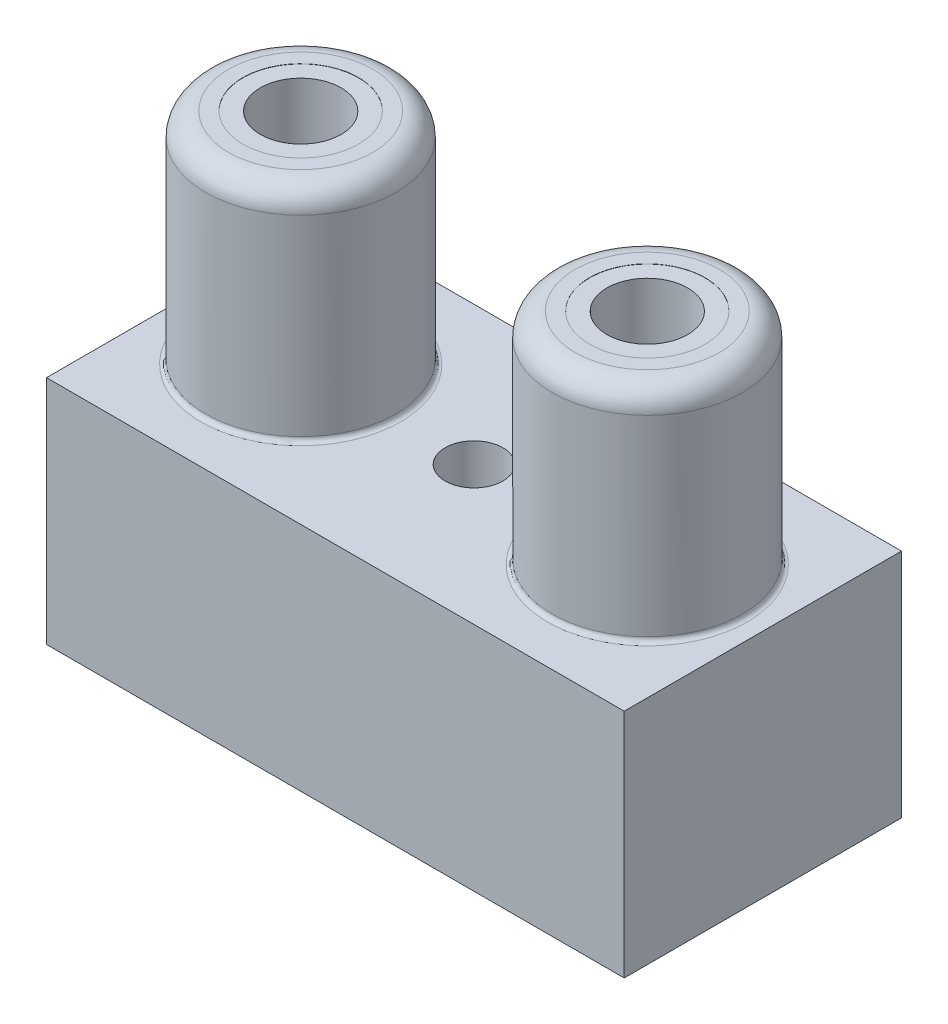
ISO-10303-21;
HEADER;
FILE_DESCRIPTION(('STEP AP214'),'2;1');
FILE_NAME('part.step','',(''),(''),'','','');
FILE_SCHEMA(('AUTOMOTIVE_DESIGN { 1 0 10303 214 1 1 1 1 }'));
ENDSEC;
DATA;
#1=APPLICATION_CONTEXT('core data for automotive mechanical design processes');
#2=APPLICATION_PROTOCOL_DEFINITION('international standard','automotive_design',2000,#1);
#3=PRODUCT_CONTEXT('',#1,'mechanical');
#4=PRODUCT('Part','Part','',(#3));
#5=PRODUCT_RELATED_PRODUCT_CATEGORY('part','',(#4));
#6=PRODUCT_DEFINITION_FORMATION('','',#4);
#7=PRODUCT_DEFINITION_CONTEXT('part definition',#1,'design');
#8=PRODUCT_DEFINITION('design','',#6,#7);
#9=PRODUCT_DEFINITION_SHAPE('','',#8);
#10=(LENGTH_UNIT() NAMED_UNIT(*) SI_UNIT(.MILLI.,.METRE.));
#11=(NAMED_UNIT(*) PLANE_ANGLE_UNIT() SI_UNIT($,.RADIAN.));
#12=(NAMED_UNIT(*) SI_UNIT($,.STERADIAN.) SOLID_ANGLE_UNIT());
#13=UNCERTAINTY_MEASURE_WITH_UNIT(LENGTH_MEASURE(1.E-05),#10,'distance_accuracy_value','');
#14=(GEOMETRIC_REPRESENTATION_CONTEXT(3) GLOBAL_UNCERTAINTY_ASSIGNED_CONTEXT((#13)) GLOBAL_UNIT_ASSIGNED_CONTEXT((#10,
#11,#12)) REPRESENTATION_CONTEXT('',''));
#15=CARTESIAN_POINT('',(0.,0.,0.));
#16=DIRECTION('',(0.,0.,1.));
#17=DIRECTION('',(1.,0.,0.));
#18=AXIS2_PLACEMENT_3D('',#15,#16,#17);
#19=CARTESIAN_POINT('',(0.,10.,0.));
#20=DIRECTION('',(0.,-1.,0.));
#21=DIRECTION('',(0.,0.,-1.));
#22=AXIS2_PLACEMENT_3D('',#19,#20,#21);
#23=PLANE('',#22);
#24=CARTESIAN_POINT('',(20.,10.,-6.));
#25=DIRECTION('',(0.,-1.,0.));
#26=DIRECTION('',(0.,0.,-1.));
#27=AXIS2_PLACEMENT_3D('',#24,#25,#26);
#28=CIRCLE('',#27,4.32);
#29=CARTESIAN_POINT('',(20.,10.,-10.32));
#30=VERTEX_POINT('',#29);
#31=EDGE_CURVE('E43',#30,#30,#28,.T.);
#32=ORIENTED_EDGE('',*,*,#31,.T.);
#33=EDGE_LOOP('',(#32));
#34=FACE_BOUND('',#33,.T.);
#35=CARTESIAN_POINT('',(5.,10.,-6.));
#36=DIRECTION('',(0.,-1.,0.));
#37=DIRECTION('',(0.,0.,-1.));
#38=AXIS2_PLACEMENT_3D('',#35,#36,#37);
#39=CIRCLE('',#38,4.32);
#40=CARTESIAN_POINT('',(5.,10.,-10.32));
#41=VERTEX_POINT('',#40);
#42=EDGE_CURVE('E126',#41,#41,#39,.T.);
#43=ORIENTED_EDGE('',*,*,#42,.T.);
#44=EDGE_LOOP('',(#43));
#45=FACE_BOUND('',#44,.T.);
#46=CARTESIAN_POINT('',(12.5,10.,-6.));
#47=DIRECTION('',(0.,1.,0.));
#48=DIRECTION('',(0.,0.,1.));
#49=AXIS2_PLACEMENT_3D('',#46,#47,#48);
#50=CIRCLE('',#49,1.25);
#51=CARTESIAN_POINT('',(12.5,10.,-4.75));
#52=VERTEX_POINT('',#51);
#53=EDGE_CURVE('E412',#52,#52,#50,.T.);
#54=ORIENTED_EDGE('',*,*,#53,.F.);
#55=EDGE_LOOP('',(#54));
#56=FACE_BOUND('',#55,.T.);
#57=DIRECTION('',(0.,0.,1.));
#58=VECTOR('',#57,1.);
#59=CARTESIAN_POINT('',(0.,10.,0.));
#60=LINE('',#59,#58);
#61=CARTESIAN_POINT('',(0.,10.,-12.));
#62=VERTEX_POINT('',#61);
#63=CARTESIAN_POINT('',(0.,10.,0.));
#64=VERTEX_POINT('',#63);
#65=EDGE_CURVE('E86',#62,#64,#60,.T.);
#66=ORIENTED_EDGE('',*,*,#65,.T.);
#67=DIRECTION('',(1.,0.,0.));
#68=VECTOR('',#67,1.);
#69=CARTESIAN_POINT('',(0.,10.,0.));
#70=LINE('',#69,#68);
#71=CARTESIAN_POINT('',(25.,10.,0.));
#72=VERTEX_POINT('',#71);
#73=EDGE_CURVE('E82',#64,#72,#70,.T.);
#74=ORIENTED_EDGE('',*,*,#73,.T.);
#75=DIRECTION('',(0.,0.,-1.));
#76=VECTOR('',#75,1.);
#77=CARTESIAN_POINT('',(25.,10.,0.));
#78=LINE('',#77,#76);
#79=CARTESIAN_POINT('',(25.,10.,-12.));
#80=VERTEX_POINT('',#79);
#81=EDGE_CURVE('E84',#72,#80,#78,.T.);
#82=ORIENTED_EDGE('',*,*,#81,.T.);
#83=DIRECTION('',(-1.,0.,0.));
#84=VECTOR('',#83,1.);
#85=CARTESIAN_POINT('',(0.,10.,-12.));
#86=LINE('',#85,#84);
#87=EDGE_CURVE('E51',#80,#62,#86,.T.);
#88=ORIENTED_EDGE('',*,*,#87,.T.);
#89=EDGE_LOOP('',(#66,#74,#82,#88));
#90=FACE_BOUND('',#89,.T.);
#91=ADVANCED_FACE('F34',(#34,#45,#56,#90),#23,.F.);
#92=CARTESIAN_POINT('',(0.,10.,0.));
#93=DIRECTION('',(1.,0.,0.));
#94=DIRECTION('',(0.,0.,-1.));
#95=AXIS2_PLACEMENT_3D('',#92,#93,#94);
#96=PLANE('',#95);
#97=DIRECTION('',(0.,0.,1.));
#98=VECTOR('',#97,1.);
#99=CARTESIAN_POINT('',(0.,0.,0.));
#100=LINE('',#99,#98);
#101=CARTESIAN_POINT('',(0.,0.,-12.));
#102=VERTEX_POINT('',#101);
#103=CARTESIAN_POINT('',(0.,0.,0.));
#104=VERTEX_POINT('',#103);
#105=EDGE_CURVE('E101',#102,#104,#100,.T.);
#106=ORIENTED_EDGE('',*,*,#105,.T.);
#107=DIRECTION('',(0.,-1.,0.));
#108=VECTOR('',#107,1.);
#109=CARTESIAN_POINT('',(0.,10.,0.));
#110=LINE('',#109,#108);
#111=EDGE_CURVE('E92',#64,#104,#110,.T.);
#112=ORIENTED_EDGE('',*,*,#111,.F.);
#113=ORIENTED_EDGE('',*,*,#65,.F.);
#114=DIRECTION('',(0.,-1.,0.));
#115=VECTOR('',#114,1.);
#116=CARTESIAN_POINT('',(0.,10.,-12.));
#117=LINE('',#116,#115);
#118=EDGE_CURVE('E97',#62,#102,#117,.T.);
#119=ORIENTED_EDGE('',*,*,#118,.T.);
#120=EDGE_LOOP('',(#106,#112,#113,#119));
#121=FACE_BOUND('',#120,.T.);
#122=ADVANCED_FACE('F190',(#121),#96,.F.);
#123=CARTESIAN_POINT('',(0.,10.,0.));
#124=DIRECTION('',(0.,0.,-1.));
#125=DIRECTION('',(-1.,0.,0.));
#126=AXIS2_PLACEMENT_3D('',#123,#124,#125);
#127=PLANE('',#126);
#128=DIRECTION('',(1.,0.,0.));
#129=VECTOR('',#128,1.);
#130=CARTESIAN_POINT('',(0.,0.,0.));
#131=LINE('',#130,#129);
#132=CARTESIAN_POINT('',(25.,0.,0.));
#133=VERTEX_POINT('',#132);
#134=EDGE_CURVE('E91',#104,#133,#131,.T.);
#135=ORIENTED_EDGE('',*,*,#134,.T.);
#136=DIRECTION('',(0.,-1.,0.));
#137=VECTOR('',#136,1.);
#138=CARTESIAN_POINT('',(25.,10.,0.));
#139=LINE('',#138,#137);
#140=EDGE_CURVE('E89',#72,#133,#139,.T.);
#141=ORIENTED_EDGE('',*,*,#140,.F.);
#142=ORIENTED_EDGE('',*,*,#73,.F.);
#143=ORIENTED_EDGE('',*,*,#111,.T.);
#144=EDGE_LOOP('',(#135,#141,#142,#143));
#145=FACE_BOUND('',#144,.T.);
#146=ADVANCED_FACE('F90',(#145),#127,.F.);
#147=CARTESIAN_POINT('',(25.,10.,0.));
#148=DIRECTION('',(-1.,0.,0.));
#149=DIRECTION('',(0.,0.,1.));
#150=AXIS2_PLACEMENT_3D('',#147,#148,#149);
#151=PLANE('',#150);
#152=DIRECTION('',(0.,0.,-1.));
#153=VECTOR('',#152,1.);
#154=CARTESIAN_POINT('',(25.,0.,0.));
#155=LINE('',#154,#153);
#156=CARTESIAN_POINT('',(25.,0.,-12.));
#157=VERTEX_POINT('',#156);
#158=EDGE_CURVE('E68',#133,#157,#155,.T.);
#159=ORIENTED_EDGE('',*,*,#158,.T.);
#160=DIRECTION('',(0.,-1.,0.));
#161=VECTOR('',#160,1.);
#162=CARTESIAN_POINT('',(25.,10.,-12.));
#163=LINE('',#162,#161);
#164=EDGE_CURVE('E93',#80,#157,#163,.T.);
#165=ORIENTED_EDGE('',*,*,#164,.F.);
#166=ORIENTED_EDGE('',*,*,#81,.F.);
#167=ORIENTED_EDGE('',*,*,#140,.T.);
#168=EDGE_LOOP('',(#159,#165,#166,#167));
#169=FACE_BOUND('',#168,.T.);
#170=ADVANCED_FACE('F95',(#169),#151,.F.);
#171=CARTESIAN_POINT('',(0.,10.,-12.));
#172=DIRECTION('',(0.,0.,1.));
#173=DIRECTION('',(1.,0.,0.));
#174=AXIS2_PLACEMENT_3D('',#171,#172,#173);
#175=PLANE('',#174);
#176=DIRECTION('',(-1.,0.,0.));
#177=VECTOR('',#176,1.);
#178=CARTESIAN_POINT('',(0.,0.,-12.));
#179=LINE('',#178,#177);
#180=EDGE_CURVE('E74',#157,#102,#179,.T.);
#181=ORIENTED_EDGE('',*,*,#180,.T.);
#182=ORIENTED_EDGE('',*,*,#118,.F.);
#183=ORIENTED_EDGE('',*,*,#87,.F.);
#184=ORIENTED_EDGE('',*,*,#164,.T.);
#185=EDGE_LOOP('',(#181,#182,#183,#184));
#186=FACE_BOUND('',#185,.T.);
#187=ADVANCED_FACE('F200',(#186),#175,.F.);
#188=CARTESIAN_POINT('',(0.,0.,0.));
#189=DIRECTION('',(0.,-1.,0.));
#190=DIRECTION('',(0.,0.,-1.));
#191=AXIS2_PLACEMENT_3D('',#188,#189,#190);
#192=PLANE('',#191);
#193=CARTESIAN_POINT('',(12.5,0.,-6.));
#194=DIRECTION('',(0.,1.,0.));
#195=DIRECTION('',(0.,0.,1.));
#196=AXIS2_PLACEMENT_3D('',#193,#194,#195);
#197=CIRCLE('',#196,1.25);
#198=CARTESIAN_POINT('',(12.5,0.,-4.75));
#199=VERTEX_POINT('',#198);
#200=EDGE_CURVE('E410',#199,#199,#197,.T.);
#201=ORIENTED_EDGE('',*,*,#200,.T.);
#202=EDGE_LOOP('',(#201));
#203=FACE_BOUND('',#202,.T.);
#204=ORIENTED_EDGE('',*,*,#105,.F.);
#205=ORIENTED_EDGE('',*,*,#180,.F.);
#206=ORIENTED_EDGE('',*,*,#158,.F.);
#207=ORIENTED_EDGE('',*,*,#134,.F.);
#208=EDGE_LOOP('',(#204,#205,#206,#207));
#209=FACE_BOUND('',#208,.T.);
#210=ADVANCED_FACE('F186',(#203,#209),#192,.T.);
#211=CARTESIAN_POINT('',(5.,19.5,-6.));
#212=DIRECTION('',(0.,-1.,0.));
#213=DIRECTION('',(0.,0.,-1.));
#214=AXIS2_PLACEMENT_3D('',#211,#212,#213);
#215=CYLINDRICAL_SURFACE('',#214,4.12);
#216=CARTESIAN_POINT('',(5.,10.2,-6.));
#217=DIRECTION('',(0.,-1.,0.));
#218=DIRECTION('',(0.,0.,-1.));
#219=AXIS2_PLACEMENT_3D('',#216,#217,#218);
#220=CIRCLE('',#219,4.12);
#221=CARTESIAN_POINT('',(5.,10.2,-10.12));
#222=VERTEX_POINT('',#221);
#223=EDGE_CURVE('E11',#222,#222,#220,.F.);
#224=ORIENTED_EDGE('',*,*,#223,.T.);
#225=EDGE_LOOP('',(#224));
#226=FACE_BOUND('',#225,.T.);
#227=CARTESIAN_POINT('',(5.,18.5,-6.));
#228=DIRECTION('',(0.,1.,0.));
#229=DIRECTION('',(0.,0.,1.));
#230=AXIS2_PLACEMENT_3D('',#227,#228,#229);
#231=CIRCLE('',#230,4.12);
#232=CARTESIAN_POINT('',(5.,18.5,-1.88));
#233=VERTEX_POINT('',#232);
#234=EDGE_CURVE('E120',#233,#233,#231,.F.);
#235=ORIENTED_EDGE('',*,*,#234,.T.);
#236=EDGE_LOOP('',(#235));
#237=FACE_BOUND('',#236,.T.);
#238=ADVANCED_FACE('F180',(#226,#237),#215,.T.);
#239=CARTESIAN_POINT('',(5.,19.5,-6.));
#240=DIRECTION('',(0.,1.,0.));
#241=DIRECTION('',(0.,0.,1.));
#242=AXIS2_PLACEMENT_3D('',#239,#240,#241);
#243=PLANE('',#242);
#244=CARTESIAN_POINT('',(5.,19.5,-6.));
#245=DIRECTION('',(0.,1.,0.));
#246=DIRECTION('',(0.,0.,1.));
#247=AXIS2_PLACEMENT_3D('',#244,#245,#246);
#248=CIRCLE('',#247,3.12);
#249=CARTESIAN_POINT('',(5.,19.5,-2.88));
#250=VERTEX_POINT('',#249);
#251=EDGE_CURVE('E117',#250,#250,#248,.T.);
#252=ORIENTED_EDGE('',*,*,#251,.T.);
#253=EDGE_LOOP('',(#252));
#254=FACE_BOUND('',#253,.T.);
#255=CARTESIAN_POINT('',(5.,19.5,-6.));
#256=DIRECTION('',(0.,1.,0.));
#257=DIRECTION('',(0.,0.,1.));
#258=AXIS2_PLACEMENT_3D('',#255,#256,#257);
#259=CIRCLE('',#258,2.5);
#260=CARTESIAN_POINT('',(5.,19.5,-3.5));
#261=VERTEX_POINT('',#260);
#262=EDGE_CURVE('E166',#261,#261,#259,.T.);
#263=ORIENTED_EDGE('',*,*,#262,.F.);
#264=EDGE_LOOP('',(#263));
#265=FACE_BOUND('',#264,.T.);
#266=ADVANCED_FACE('F143',(#254,#265),#243,.T.);
#267=CARTESIAN_POINT('',(20.,19.5,-6.));
#268=DIRECTION('',(0.,-1.,0.));
#269=DIRECTION('',(0.,0.,-1.));
#270=AXIS2_PLACEMENT_3D('',#267,#268,#269);
#271=CYLINDRICAL_SURFACE('',#270,4.12);
#272=CARTESIAN_POINT('',(20.,10.2,-6.));
#273=DIRECTION('',(0.,-1.,0.));
#274=DIRECTION('',(0.,0.,-1.));
#275=AXIS2_PLACEMENT_3D('',#272,#273,#274);
#276=CIRCLE('',#275,4.12);
#277=CARTESIAN_POINT('',(20.,10.2,-10.12));
#278=VERTEX_POINT('',#277);
#279=EDGE_CURVE('E123',#278,#278,#276,.F.);
#280=ORIENTED_EDGE('',*,*,#279,.T.);
#281=EDGE_LOOP('',(#280));
#282=FACE_BOUND('',#281,.T.);
#283=CARTESIAN_POINT('',(20.,18.5,-6.));
#284=DIRECTION('',(0.,1.,0.));
#285=DIRECTION('',(0.,0.,1.));
#286=AXIS2_PLACEMENT_3D('',#283,#284,#285);
#287=CIRCLE('',#286,4.12);
#288=CARTESIAN_POINT('',(20.,18.5,-1.88));
#289=VERTEX_POINT('',#288);
#290=EDGE_CURVE('E114',#289,#289,#287,.F.);
#291=ORIENTED_EDGE('',*,*,#290,.T.);
#292=EDGE_LOOP('',(#291));
#293=FACE_BOUND('',#292,.T.);
#294=ADVANCED_FACE('F139',(#282,#293),#271,.T.);
#295=CARTESIAN_POINT('',(20.,19.5,-6.));
#296=DIRECTION('',(0.,1.,0.));
#297=DIRECTION('',(0.,0.,1.));
#298=AXIS2_PLACEMENT_3D('',#295,#296,#297);
#299=PLANE('',#298);
#300=CARTESIAN_POINT('',(20.,19.5,-6.));
#301=DIRECTION('',(0.,1.,0.));
#302=DIRECTION('',(0.,0.,1.));
#303=AXIS2_PLACEMENT_3D('',#300,#301,#302);
#304=CIRCLE('',#303,3.12);
#305=CARTESIAN_POINT('',(20.,19.5,-2.88));
#306=VERTEX_POINT('',#305);
#307=EDGE_CURVE('E111',#306,#306,#304,.T.);
#308=ORIENTED_EDGE('',*,*,#307,.T.);
#309=EDGE_LOOP('',(#308));
#310=FACE_BOUND('',#309,.T.);
#311=CARTESIAN_POINT('',(20.,19.5,-6.));
#312=DIRECTION('',(0.,1.,0.));
#313=DIRECTION('',(0.,0.,1.));
#314=AXIS2_PLACEMENT_3D('',#311,#312,#313);
#315=CIRCLE('',#314,2.5);
#316=CARTESIAN_POINT('',(20.,19.5,-3.5));
#317=VERTEX_POINT('',#316);
#318=EDGE_CURVE('E160',#317,#317,#315,.T.);
#319=ORIENTED_EDGE('',*,*,#318,.F.);
#320=EDGE_LOOP('',(#319));
#321=FACE_BOUND('',#320,.T.);
#322=ADVANCED_FACE('F142',(#310,#321),#299,.T.);
#323=CARTESIAN_POINT('',(5.,19.49,-6.));
#324=DIRECTION('',(0.,1.,0.));
#325=DIRECTION('',(0.,0.,1.));
#326=AXIS2_PLACEMENT_3D('',#323,#324,#325);
#327=CYLINDRICAL_SURFACE('',#326,2.5);
#328=CARTESIAN_POINT('',(5.,19.49,-6.));
#329=DIRECTION('',(0.,1.,0.));
#330=DIRECTION('',(0.,0.,1.));
#331=AXIS2_PLACEMENT_3D('',#328,#329,#330);
#332=CIRCLE('',#331,2.5);
#333=CARTESIAN_POINT('',(5.,19.49,-3.5));
#334=VERTEX_POINT('',#333);
#335=EDGE_CURVE('E104',#334,#334,#332,.T.);
#336=ORIENTED_EDGE('',*,*,#335,.F.);
#337=EDGE_LOOP('',(#336));
#338=FACE_BOUND('',#337,.T.);
#339=ORIENTED_EDGE('',*,*,#262,.T.);
#340=EDGE_LOOP('',(#339));
#341=FACE_BOUND('',#340,.T.);
#342=ADVANCED_FACE('F156',(#338,#341),#327,.F.);
#343=CARTESIAN_POINT('',(5.,19.49,-6.));
#344=DIRECTION('',(0.,1.,0.));
#345=DIRECTION('',(0.,0.,1.));
#346=AXIS2_PLACEMENT_3D('',#343,#344,#345);
#347=PLANE('',#346);
#348=CARTESIAN_POINT('',(5.,19.49,-6.));
#349=DIRECTION('',(0.,1.,0.));
#350=DIRECTION('',(0.,0.,1.));
#351=AXIS2_PLACEMENT_3D('',#348,#349,#350);
#352=CIRCLE('',#351,1.75);
#353=CARTESIAN_POINT('',(5.,19.49,-4.25));
#354=VERTEX_POINT('',#353);
#355=EDGE_CURVE('E169',#354,#354,#352,.T.);
#356=ORIENTED_EDGE('',*,*,#355,.F.);
#357=EDGE_LOOP('',(#356));
#358=FACE_BOUND('',#357,.T.);
#359=ORIENTED_EDGE('',*,*,#335,.T.);
#360=EDGE_LOOP('',(#359));
#361=FACE_BOUND('',#360,.T.);
#362=ADVANCED_FACE('F305',(#358,#361),#347,.T.);
#363=CARTESIAN_POINT('',(20.,19.49,-6.));
#364=DIRECTION('',(0.,1.,0.));
#365=DIRECTION('',(0.,0.,1.));
#366=AXIS2_PLACEMENT_3D('',#363,#364,#365);
#367=CYLINDRICAL_SURFACE('',#366,2.5);
#368=CARTESIAN_POINT('',(20.,19.49,-6.));
#369=DIRECTION('',(0.,1.,0.));
#370=DIRECTION('',(0.,0.,1.));
#371=AXIS2_PLACEMENT_3D('',#368,#369,#370);
#372=CIRCLE('',#371,2.5);
#373=CARTESIAN_POINT('',(20.,19.49,-3.5));
#374=VERTEX_POINT('',#373);
#375=EDGE_CURVE('E162',#374,#374,#372,.T.);
#376=ORIENTED_EDGE('',*,*,#375,.F.);
#377=EDGE_LOOP('',(#376));
#378=FACE_BOUND('',#377,.T.);
#379=ORIENTED_EDGE('',*,*,#318,.T.);
#380=EDGE_LOOP('',(#379));
#381=FACE_BOUND('',#380,.T.);
#382=ADVANCED_FACE('F294',(#378,#381),#367,.F.);
#383=CARTESIAN_POINT('',(20.,19.49,-6.));
#384=DIRECTION('',(0.,1.,0.));
#385=DIRECTION('',(0.,0.,1.));
#386=AXIS2_PLACEMENT_3D('',#383,#384,#385);
#387=PLANE('',#386);
#388=CARTESIAN_POINT('',(20.,19.49,-6.));
#389=DIRECTION('',(0.,1.,0.));
#390=DIRECTION('',(0.,0.,1.));
#391=AXIS2_PLACEMENT_3D('',#388,#389,#390);
#392=CIRCLE('',#391,1.75);
#393=CARTESIAN_POINT('',(20.,19.49,-4.25));
#394=VERTEX_POINT('',#393);
#395=EDGE_CURVE('E406',#394,#394,#392,.T.);
#396=ORIENTED_EDGE('',*,*,#395,.F.);
#397=EDGE_LOOP('',(#396));
#398=FACE_BOUND('',#397,.T.);
#399=ORIENTED_EDGE('',*,*,#375,.T.);
#400=EDGE_LOOP('',(#399));
#401=FACE_BOUND('',#400,.T.);
#402=ADVANCED_FACE('F285',(#398,#401),#387,.T.);
#403=CARTESIAN_POINT('',(5.,4.49,-6.));
#404=DIRECTION('',(0.,1.,0.));
#405=DIRECTION('',(0.,0.,1.));
#406=AXIS2_PLACEMENT_3D('',#403,#404,#405);
#407=CYLINDRICAL_SURFACE('',#406,1.75);
#408=CARTESIAN_POINT('',(5.,4.49,-6.));
#409=DIRECTION('',(0.,1.,0.));
#410=DIRECTION('',(0.,0.,1.));
#411=AXIS2_PLACEMENT_3D('',#408,#409,#410);
#412=CIRCLE('',#411,1.75);
#413=CARTESIAN_POINT('',(5.,4.49,-4.25));
#414=VERTEX_POINT('',#413);
#415=EDGE_CURVE('E163',#414,#414,#412,.T.);
#416=ORIENTED_EDGE('',*,*,#415,.F.);
#417=EDGE_LOOP('',(#416));
#418=FACE_BOUND('',#417,.T.);
#419=ORIENTED_EDGE('',*,*,#355,.T.);
#420=EDGE_LOOP('',(#419));
#421=FACE_BOUND('',#420,.T.);
#422=ADVANCED_FACE('F276',(#418,#421),#407,.F.);
#423=CARTESIAN_POINT('',(5.,4.49,-6.));
#424=DIRECTION('',(0.,1.,0.));
#425=DIRECTION('',(0.,0.,1.));
#426=AXIS2_PLACEMENT_3D('',#423,#424,#425);
#427=PLANE('',#426);
#428=ORIENTED_EDGE('',*,*,#415,.T.);
#429=EDGE_LOOP('',(#428));
#430=FACE_BOUND('',#429,.T.);
#431=ADVANCED_FACE('F267',(#430),#427,.T.);
#432=CARTESIAN_POINT('',(20.,4.49,-6.));
#433=DIRECTION('',(0.,1.,0.));
#434=DIRECTION('',(0.,0.,1.));
#435=AXIS2_PLACEMENT_3D('',#432,#433,#434);
#436=CYLINDRICAL_SURFACE('',#435,1.75);
#437=CARTESIAN_POINT('',(20.,4.49,-6.));
#438=DIRECTION('',(0.,1.,0.));
#439=DIRECTION('',(0.,0.,1.));
#440=AXIS2_PLACEMENT_3D('',#437,#438,#439);
#441=CIRCLE('',#440,1.75);
#442=CARTESIAN_POINT('',(20.,4.49,-4.25));
#443=VERTEX_POINT('',#442);
#444=EDGE_CURVE('E404',#443,#443,#441,.T.);
#445=ORIENTED_EDGE('',*,*,#444,.F.);
#446=EDGE_LOOP('',(#445));
#447=FACE_BOUND('',#446,.T.);
#448=ORIENTED_EDGE('',*,*,#395,.T.);
#449=EDGE_LOOP('',(#448));
#450=FACE_BOUND('',#449,.T.);
#451=ADVANCED_FACE('F258',(#447,#450),#436,.F.);
#452=CARTESIAN_POINT('',(20.,4.49,-6.));
#453=DIRECTION('',(0.,1.,0.));
#454=DIRECTION('',(0.,0.,1.));
#455=AXIS2_PLACEMENT_3D('',#452,#453,#454);
#456=PLANE('',#455);
#457=ORIENTED_EDGE('',*,*,#444,.T.);
#458=EDGE_LOOP('',(#457));
#459=FACE_BOUND('',#458,.T.);
#460=ADVANCED_FACE('F248',(#459),#456,.T.);
#461=CARTESIAN_POINT('',(12.5,0.,-6.));
#462=DIRECTION('',(0.,1.,0.));
#463=DIRECTION('',(0.,0.,1.));
#464=AXIS2_PLACEMENT_3D('',#461,#462,#463);
#465=CYLINDRICAL_SURFACE('',#464,1.25);
#466=ORIENTED_EDGE('',*,*,#200,.F.);
#467=EDGE_LOOP('',(#466));
#468=FACE_BOUND('',#467,.T.);
#469=ORIENTED_EDGE('',*,*,#53,.T.);
#470=EDGE_LOOP('',(#469));
#471=FACE_BOUND('',#470,.T.);
#472=ADVANCED_FACE('F150',(#468,#471),#465,.F.);
#473=CARTESIAN_POINT('',(20.,18.5,-6.));
#474=DIRECTION('',(0.,1.,0.));
#475=DIRECTION('',(0.,0.,1.));
#476=AXIS2_PLACEMENT_3D('',#473,#474,#475);
#477=TOROIDAL_SURFACE('',#476,3.12,1.);
#478=ORIENTED_EDGE('',*,*,#290,.F.);
#479=EDGE_LOOP('',(#478));
#480=FACE_BOUND('',#479,.T.);
#481=ORIENTED_EDGE('',*,*,#307,.F.);
#482=EDGE_LOOP('',(#481));
#483=FACE_BOUND('',#482,.T.);
#484=ADVANCED_FACE('F147',(#480,#483),#477,.T.);
#485=CARTESIAN_POINT('',(5.,18.5,-6.));
#486=DIRECTION('',(0.,1.,0.));
#487=DIRECTION('',(0.,0.,1.));
#488=AXIS2_PLACEMENT_3D('',#485,#486,#487);
#489=TOROIDAL_SURFACE('',#488,3.12,1.);
#490=ORIENTED_EDGE('',*,*,#234,.F.);
#491=EDGE_LOOP('',(#490));
#492=FACE_BOUND('',#491,.T.);
#493=ORIENTED_EDGE('',*,*,#251,.F.);
#494=EDGE_LOOP('',(#493));
#495=FACE_BOUND('',#494,.T.);
#496=ADVANCED_FACE('F136',(#492,#495),#489,.T.);
#497=CARTESIAN_POINT('',(20.,10.2,-6.));
#498=DIRECTION('',(0.,-1.,0.));
#499=DIRECTION('',(0.,0.,-1.));
#500=AXIS2_PLACEMENT_3D('',#497,#498,#499);
#501=TOROIDAL_SURFACE('',#500,4.32,0.2);
#502=ORIENTED_EDGE('',*,*,#31,.F.);
#503=EDGE_LOOP('',(#502));
#504=FACE_BOUND('',#503,.T.);
#505=ORIENTED_EDGE('',*,*,#279,.F.);
#506=EDGE_LOOP('',(#505));
#507=FACE_BOUND('',#506,.T.);
#508=ADVANCED_FACE('F133',(#504,#507),#501,.F.);
#509=CARTESIAN_POINT('',(5.,10.2,-6.));
#510=DIRECTION('',(0.,-1.,0.));
#511=DIRECTION('',(0.,0.,-1.));
#512=AXIS2_PLACEMENT_3D('',#509,#510,#511);
#513=TOROIDAL_SURFACE('',#512,4.32,0.2);
#514=ORIENTED_EDGE('',*,*,#42,.F.);
#515=EDGE_LOOP('',(#514));
#516=FACE_BOUND('',#515,.T.);
#517=ORIENTED_EDGE('',*,*,#223,.F.);
#518=EDGE_LOOP('',(#517));
#519=FACE_BOUND('',#518,.T.);
#520=ADVANCED_FACE('F36',(#516,#519),#513,.F.);
#521=CLOSED_SHELL('',(#91,#122,#146,#170,#187,#210,#238,#266,#294,#322,#342,#362,#382,#402,#422,
#431,#451,#460,#472,#484,#496,#508,#520));
#522=MANIFOLD_SOLID_BREP('B2',#521);
#523=ADVANCED_BREP_SHAPE_REPRESENTATION('',(#18,#522),#14);
#524=SHAPE_DEFINITION_REPRESENTATION(#9,#523);
ENDSEC;
END-ISO-10303-21;
